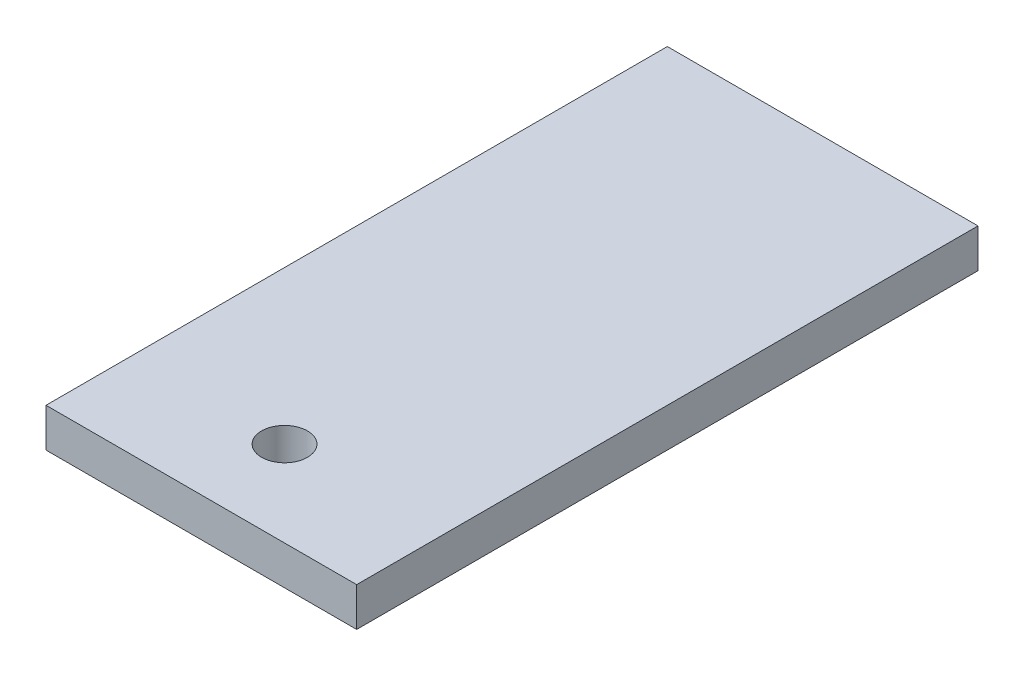
ISO-10303-21;
HEADER;
FILE_DESCRIPTION(('STEP AP214'),'2;1');
FILE_NAME('part.step','',(''),(''),'','','');
FILE_SCHEMA(('AUTOMOTIVE_DESIGN { 1 0 10303 214 1 1 1 1 }'));
ENDSEC;
DATA;
#1=APPLICATION_CONTEXT('core data for automotive mechanical design processes');
#2=APPLICATION_PROTOCOL_DEFINITION('international standard','automotive_design',2000,#1);
#3=PRODUCT_CONTEXT('',#1,'mechanical');
#4=PRODUCT('Part','Part','',(#3));
#5=PRODUCT_RELATED_PRODUCT_CATEGORY('part','',(#4));
#6=PRODUCT_DEFINITION_FORMATION('','',#4);
#7=PRODUCT_DEFINITION_CONTEXT('part definition',#1,'design');
#8=PRODUCT_DEFINITION('design','',#6,#7);
#9=PRODUCT_DEFINITION_SHAPE('','',#8);
#10=(LENGTH_UNIT() NAMED_UNIT(*) SI_UNIT(.MILLI.,.METRE.));
#11=(NAMED_UNIT(*) PLANE_ANGLE_UNIT() SI_UNIT($,.RADIAN.));
#12=(NAMED_UNIT(*) SI_UNIT($,.STERADIAN.) SOLID_ANGLE_UNIT());
#13=UNCERTAINTY_MEASURE_WITH_UNIT(LENGTH_MEASURE(1.E-05),#10,'distance_accuracy_value','');
#14=(GEOMETRIC_REPRESENTATION_CONTEXT(3) GLOBAL_UNCERTAINTY_ASSIGNED_CONTEXT((#13)) GLOBAL_UNIT_ASSIGNED_CONTEXT((#10,
#11,#12)) REPRESENTATION_CONTEXT('',''));
#15=CARTESIAN_POINT('',(0.,0.,0.));
#16=DIRECTION('',(0.,0.,1.));
#17=DIRECTION('',(1.,0.,0.));
#18=AXIS2_PLACEMENT_3D('',#15,#16,#17);
#19=CARTESIAN_POINT('',(0.,25.4,0.));
#20=DIRECTION('',(1.,0.,0.));
#21=DIRECTION('',(0.,0.,-1.));
#22=AXIS2_PLACEMENT_3D('',#19,#20,#21);
#23=PLANE('',#22);
#24=DIRECTION('',(0.,0.,1.));
#25=VECTOR('',#24,1.);
#26=CARTESIAN_POINT('',(0.,0.,0.));
#27=LINE('',#26,#25);
#28=CARTESIAN_POINT('',(0.,0.,-406.4));
#29=VERTEX_POINT('',#28);
#30=CARTESIAN_POINT('',(0.,0.,0.));
#31=VERTEX_POINT('',#30);
#32=EDGE_CURVE('E94',#29,#31,#27,.T.);
#33=ORIENTED_EDGE('',*,*,#32,.T.);
#34=DIRECTION('',(0.,-1.,0.));
#35=VECTOR('',#34,1.);
#36=CARTESIAN_POINT('',(0.,25.4,0.));
#37=LINE('',#36,#35);
#38=CARTESIAN_POINT('',(0.,25.4,0.));
#39=VERTEX_POINT('',#38);
#40=EDGE_CURVE('E11',#39,#31,#37,.T.);
#41=ORIENTED_EDGE('',*,*,#40,.F.);
#42=DIRECTION('',(0.,0.,1.));
#43=VECTOR('',#42,1.);
#44=CARTESIAN_POINT('',(0.,25.4,0.));
#45=LINE('',#44,#43);
#46=CARTESIAN_POINT('',(0.,25.4,-406.4));
#47=VERTEX_POINT('',#46);
#48=EDGE_CURVE('E82',#47,#39,#45,.T.);
#49=ORIENTED_EDGE('',*,*,#48,.F.);
#50=DIRECTION('',(0.,-1.,0.));
#51=VECTOR('',#50,1.);
#52=CARTESIAN_POINT('',(0.,25.4,-406.4));
#53=LINE('',#52,#51);
#54=EDGE_CURVE('E90',#47,#29,#53,.T.);
#55=ORIENTED_EDGE('',*,*,#54,.T.);
#56=EDGE_LOOP('',(#33,#41,#49,#55));
#57=FACE_BOUND('',#56,.T.);
#58=ADVANCED_FACE('F31',(#57),#23,.F.);
#59=CARTESIAN_POINT('',(0.,25.4,0.));
#60=DIRECTION('',(0.,0.,-1.));
#61=DIRECTION('',(-1.,0.,0.));
#62=AXIS2_PLACEMENT_3D('',#59,#60,#61);
#63=PLANE('',#62);
#64=DIRECTION('',(1.,0.,0.));
#65=VECTOR('',#64,1.);
#66=CARTESIAN_POINT('',(0.,0.,0.));
#67=LINE('',#66,#65);
#68=CARTESIAN_POINT('',(203.2,0.,0.));
#69=VERTEX_POINT('',#68);
#70=EDGE_CURVE('E86',#31,#69,#67,.T.);
#71=ORIENTED_EDGE('',*,*,#70,.T.);
#72=DIRECTION('',(0.,-1.,0.));
#73=VECTOR('',#72,1.);
#74=CARTESIAN_POINT('',(203.2,25.4,0.));
#75=LINE('',#74,#73);
#76=CARTESIAN_POINT('',(203.2,25.4,0.));
#77=VERTEX_POINT('',#76);
#78=EDGE_CURVE('E39',#77,#69,#75,.T.);
#79=ORIENTED_EDGE('',*,*,#78,.F.);
#80=DIRECTION('',(1.,0.,0.));
#81=VECTOR('',#80,1.);
#82=CARTESIAN_POINT('',(0.,25.4,0.));
#83=LINE('',#82,#81);
#84=EDGE_CURVE('E77',#39,#77,#83,.T.);
#85=ORIENTED_EDGE('',*,*,#84,.F.);
#86=ORIENTED_EDGE('',*,*,#40,.T.);
#87=EDGE_LOOP('',(#71,#79,#85,#86));
#88=FACE_BOUND('',#87,.T.);
#89=ADVANCED_FACE('F85',(#88),#63,.F.);
#90=CARTESIAN_POINT('',(203.2,25.4,0.));
#91=DIRECTION('',(-1.,0.,0.));
#92=DIRECTION('',(0.,0.,1.));
#93=AXIS2_PLACEMENT_3D('',#90,#91,#92);
#94=PLANE('',#93);
#95=DIRECTION('',(0.,0.,-1.));
#96=VECTOR('',#95,1.);
#97=CARTESIAN_POINT('',(203.2,0.,0.));
#98=LINE('',#97,#96);
#99=CARTESIAN_POINT('',(203.2,0.,-406.4));
#100=VERTEX_POINT('',#99);
#101=EDGE_CURVE('E64',#69,#100,#98,.T.);
#102=ORIENTED_EDGE('',*,*,#101,.T.);
#103=DIRECTION('',(0.,-1.,0.));
#104=VECTOR('',#103,1.);
#105=CARTESIAN_POINT('',(203.2,25.4,-406.4));
#106=LINE('',#105,#104);
#107=CARTESIAN_POINT('',(203.2,25.4,-406.4));
#108=VERTEX_POINT('',#107);
#109=EDGE_CURVE('E87',#108,#100,#106,.T.);
#110=ORIENTED_EDGE('',*,*,#109,.F.);
#111=DIRECTION('',(0.,0.,-1.));
#112=VECTOR('',#111,1.);
#113=CARTESIAN_POINT('',(203.2,25.4,0.));
#114=LINE('',#113,#112);
#115=EDGE_CURVE('E80',#77,#108,#114,.T.);
#116=ORIENTED_EDGE('',*,*,#115,.F.);
#117=ORIENTED_EDGE('',*,*,#78,.T.);
#118=EDGE_LOOP('',(#102,#110,#116,#117));
#119=FACE_BOUND('',#118,.T.);
#120=ADVANCED_FACE('F88',(#119),#94,.F.);
#121=CARTESIAN_POINT('',(0.,25.4,-406.4));
#122=DIRECTION('',(0.,0.,1.));
#123=DIRECTION('',(1.,0.,0.));
#124=AXIS2_PLACEMENT_3D('',#121,#122,#123);
#125=PLANE('',#124);
#126=DIRECTION('',(-1.,0.,0.));
#127=VECTOR('',#126,1.);
#128=CARTESIAN_POINT('',(0.,0.,-406.4));
#129=LINE('',#128,#127);
#130=EDGE_CURVE('E70',#100,#29,#129,.T.);
#131=ORIENTED_EDGE('',*,*,#130,.T.);
#132=ORIENTED_EDGE('',*,*,#54,.F.);
#133=DIRECTION('',(-1.,0.,0.));
#134=VECTOR('',#133,1.);
#135=CARTESIAN_POINT('',(0.,25.4,-406.4));
#136=LINE('',#135,#134);
#137=EDGE_CURVE('E47',#108,#47,#136,.T.);
#138=ORIENTED_EDGE('',*,*,#137,.F.);
#139=ORIENTED_EDGE('',*,*,#109,.T.);
#140=EDGE_LOOP('',(#131,#132,#138,#139));
#141=FACE_BOUND('',#140,.T.);
#142=ADVANCED_FACE('F102',(#141),#125,.F.);
#143=CARTESIAN_POINT('',(0.,25.4,-406.4));
#144=DIRECTION('',(0.,-1.,0.));
#145=DIRECTION('',(0.,0.,-1.));
#146=AXIS2_PLACEMENT_3D('',#143,#144,#145);
#147=PLANE('',#146);
#148=CARTESIAN_POINT('',(100.,25.4,-56.));
#149=DIRECTION('',(0.,1.,0.));
#150=DIRECTION('',(0.,0.,1.));
#151=AXIS2_PLACEMENT_3D('',#148,#149,#150);
#152=CIRCLE('',#151,15.0000000000001);
#153=CARTESIAN_POINT('',(100.,25.4,-40.9999999999999));
#154=VERTEX_POINT('',#153);
#155=EDGE_CURVE('E108',#154,#154,#152,.T.);
#156=ORIENTED_EDGE('',*,*,#155,.F.);
#157=EDGE_LOOP('',(#156));
#158=FACE_BOUND('',#157,.T.);
#159=ORIENTED_EDGE('',*,*,#48,.T.);
#160=ORIENTED_EDGE('',*,*,#84,.T.);
#161=ORIENTED_EDGE('',*,*,#115,.T.);
#162=ORIENTED_EDGE('',*,*,#137,.T.);
#163=EDGE_LOOP('',(#159,#160,#161,#162));
#164=FACE_BOUND('',#163,.T.);
#165=ADVANCED_FACE('F78',(#158,#164),#147,.F.);
#166=CARTESIAN_POINT('',(0.,0.,-406.4));
#167=DIRECTION('',(0.,-1.,0.));
#168=DIRECTION('',(0.,0.,-1.));
#169=AXIS2_PLACEMENT_3D('',#166,#167,#168);
#170=PLANE('',#169);
#171=CARTESIAN_POINT('',(100.,0.,-56.));
#172=DIRECTION('',(0.,1.,0.));
#173=DIRECTION('',(0.,0.,1.));
#174=AXIS2_PLACEMENT_3D('',#171,#172,#173);
#175=CIRCLE('',#174,15.0000000000001);
#176=CARTESIAN_POINT('',(100.,0.,-40.9999999999999));
#177=VERTEX_POINT('',#176);
#178=EDGE_CURVE('E97',#177,#177,#175,.T.);
#179=ORIENTED_EDGE('',*,*,#178,.T.);
#180=EDGE_LOOP('',(#179));
#181=FACE_BOUND('',#180,.T.);
#182=ORIENTED_EDGE('',*,*,#32,.F.);
#183=ORIENTED_EDGE('',*,*,#130,.F.);
#184=ORIENTED_EDGE('',*,*,#101,.F.);
#185=ORIENTED_EDGE('',*,*,#70,.F.);
#186=EDGE_LOOP('',(#182,#183,#184,#185));
#187=FACE_BOUND('',#186,.T.);
#188=ADVANCED_FACE('F105',(#181,#187),#170,.T.);
#189=CARTESIAN_POINT('',(100.,0.,-56.));
#190=DIRECTION('',(0.,1.,0.));
#191=DIRECTION('',(0.,0.,1.));
#192=AXIS2_PLACEMENT_3D('',#189,#190,#191);
#193=CYLINDRICAL_SURFACE('',#192,15.0000000000001);
#194=ORIENTED_EDGE('',*,*,#178,.F.);
#195=EDGE_LOOP('',(#194));
#196=FACE_BOUND('',#195,.T.);
#197=ORIENTED_EDGE('',*,*,#155,.T.);
#198=EDGE_LOOP('',(#197));
#199=FACE_BOUND('',#198,.T.);
#200=ADVANCED_FACE('F115',(#196,#199),#193,.F.);
#201=CLOSED_SHELL('',(#58,#89,#120,#142,#165,#188,#200));
#202=MANIFOLD_SOLID_BREP('B2',#201);
#203=ADVANCED_BREP_SHAPE_REPRESENTATION('',(#18,#202),#14);
#204=SHAPE_DEFINITION_REPRESENTATION(#9,#203);
ENDSEC;
END-ISO-10303-21;
